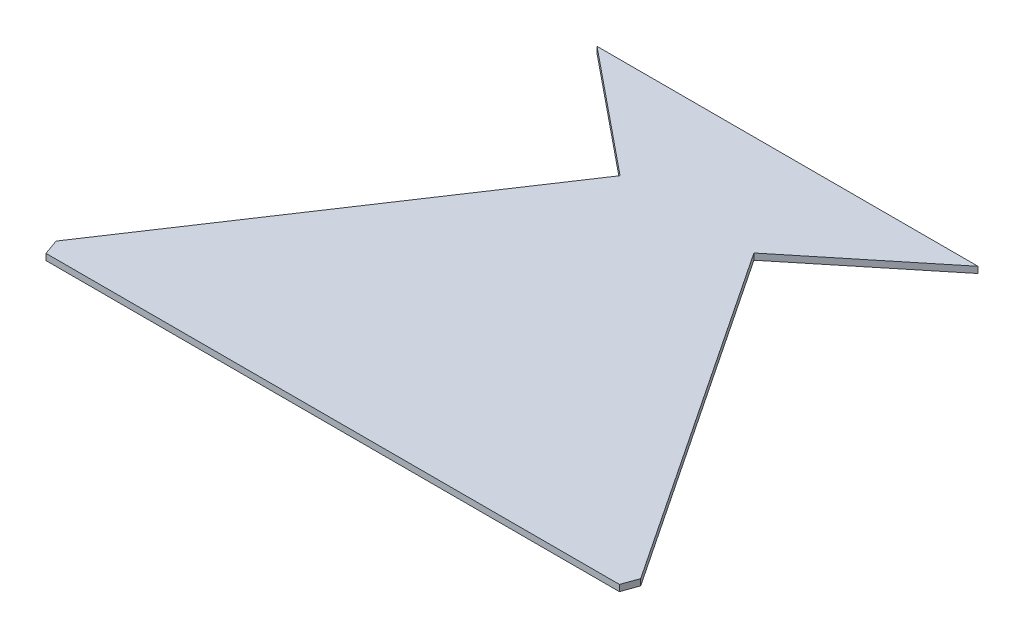
ISO-10303-21;
HEADER;
FILE_DESCRIPTION(('STEP AP214'),'2;1');
FILE_NAME('part.step','',(''),(''),'','','');
FILE_SCHEMA(('AUTOMOTIVE_DESIGN { 1 0 10303 214 1 1 1 1 }'));
ENDSEC;
DATA;
#1=APPLICATION_CONTEXT('core data for automotive mechanical design processes');
#2=APPLICATION_PROTOCOL_DEFINITION('international standard','automotive_design',2000,#1);
#3=PRODUCT_CONTEXT('',#1,'mechanical');
#4=PRODUCT('Part','Part','',(#3));
#5=PRODUCT_RELATED_PRODUCT_CATEGORY('part','',(#4));
#6=PRODUCT_DEFINITION_FORMATION('','',#4);
#7=PRODUCT_DEFINITION_CONTEXT('part definition',#1,'design');
#8=PRODUCT_DEFINITION('design','',#6,#7);
#9=PRODUCT_DEFINITION_SHAPE('','',#8);
#10=(LENGTH_UNIT() NAMED_UNIT(*) SI_UNIT(.MILLI.,.METRE.));
#11=(NAMED_UNIT(*) PLANE_ANGLE_UNIT() SI_UNIT($,.RADIAN.));
#12=(NAMED_UNIT(*) SI_UNIT($,.STERADIAN.) SOLID_ANGLE_UNIT());
#13=UNCERTAINTY_MEASURE_WITH_UNIT(LENGTH_MEASURE(1.E-05),#10,'distance_accuracy_value','');
#14=(GEOMETRIC_REPRESENTATION_CONTEXT(3) GLOBAL_UNCERTAINTY_ASSIGNED_CONTEXT((#13)) GLOBAL_UNIT_ASSIGNED_CONTEXT((#10,
#11,#12)) REPRESENTATION_CONTEXT('',''));
#15=CARTESIAN_POINT('',(0.,0.,0.));
#16=DIRECTION('',(0.,0.,1.));
#17=DIRECTION('',(1.,0.,0.));
#18=AXIS2_PLACEMENT_3D('',#15,#16,#17);
#19=CARTESIAN_POINT('',(-1.78419395601456,2.,-4.98636803668045));
#20=DIRECTION('',(0.941541493070659,0.,-0.336897041878189));
#21=DIRECTION('',(-0.336897041878189,0.,-0.941541493070659));
#22=AXIS2_PLACEMENT_3D('',#19,#20,#21);
#23=PLANE('',#22);
#24=DIRECTION('',(0.336897041878189,0.,0.941541493070659));
#25=VECTOR('',#24,1.);
#26=CARTESIAN_POINT('',(-1.78419395601456,0.,-4.98636803668045));
#27=LINE('',#26,#25);
#28=CARTESIAN_POINT('',(-1.78419395601456,0.,-4.98636803668045));
#29=VERTEX_POINT('',#28);
#30=CARTESIAN_POINT('',(0.,0.,0.));
#31=VERTEX_POINT('',#30);
#32=EDGE_CURVE('E140',#29,#31,#27,.T.);
#33=ORIENTED_EDGE('',*,*,#32,.T.);
#34=DIRECTION('',(0.,-1.,0.));
#35=VECTOR('',#34,1.);
#36=CARTESIAN_POINT('',(0.,2.,0.));
#37=LINE('',#36,#35);
#38=CARTESIAN_POINT('',(0.,2.,0.));
#39=VERTEX_POINT('',#38);
#40=EDGE_CURVE('E11',#39,#31,#37,.T.);
#41=ORIENTED_EDGE('',*,*,#40,.F.);
#42=DIRECTION('',(0.336897041878189,0.,0.941541493070659));
#43=VECTOR('',#42,1.);
#44=CARTESIAN_POINT('',(-1.78419395601456,2.,-4.98636803668045));
#45=LINE('',#44,#43);
#46=CARTESIAN_POINT('',(-1.78419395601456,2.,-4.98636803668045));
#47=VERTEX_POINT('',#46);
#48=EDGE_CURVE('E162',#47,#39,#45,.T.);
#49=ORIENTED_EDGE('',*,*,#48,.F.);
#50=DIRECTION('',(0.,-1.,0.));
#51=VECTOR('',#50,1.);
#52=CARTESIAN_POINT('',(-1.78419395601456,2.,-4.98636803668045));
#53=LINE('',#52,#51);
#54=EDGE_CURVE('E136',#47,#29,#53,.T.);
#55=ORIENTED_EDGE('',*,*,#54,.T.);
#56=EDGE_LOOP('',(#33,#41,#49,#55));
#57=FACE_BOUND('',#56,.T.);
#58=ADVANCED_FACE('F39',(#57),#23,.F.);
#59=CARTESIAN_POINT('',(0.,2.,0.));
#60=DIRECTION('',(0.,0.,-1.));
#61=DIRECTION('',(-1.,0.,0.));
#62=AXIS2_PLACEMENT_3D('',#59,#60,#61);
#63=PLANE('',#62);
#64=DIRECTION('',(1.,0.,0.));
#65=VECTOR('',#64,1.);
#66=CARTESIAN_POINT('',(0.,0.,0.));
#67=LINE('',#66,#65);
#68=CARTESIAN_POINT('',(182.41594950499,0.,0.));
#69=VERTEX_POINT('',#68);
#70=EDGE_CURVE('E144',#31,#69,#67,.T.);
#71=ORIENTED_EDGE('',*,*,#70,.T.);
#72=DIRECTION('',(0.,-1.,0.));
#73=VECTOR('',#72,1.);
#74=CARTESIAN_POINT('',(182.41594950499,2.,0.));
#75=LINE('',#74,#73);
#76=CARTESIAN_POINT('',(182.41594950499,2.,0.));
#77=VERTEX_POINT('',#76);
#78=EDGE_CURVE('E48',#77,#69,#75,.T.);
#79=ORIENTED_EDGE('',*,*,#78,.F.);
#80=DIRECTION('',(1.,0.,0.));
#81=VECTOR('',#80,1.);
#82=CARTESIAN_POINT('',(0.,2.,0.));
#83=LINE('',#82,#81);
#84=EDGE_CURVE('E99',#39,#77,#83,.T.);
#85=ORIENTED_EDGE('',*,*,#84,.F.);
#86=ORIENTED_EDGE('',*,*,#40,.T.);
#87=EDGE_LOOP('',(#71,#79,#85,#86));
#88=FACE_BOUND('',#87,.T.);
#89=ADVANCED_FACE('F208',(#88),#63,.F.);
#90=CARTESIAN_POINT('',(182.41594950499,2.,0.));
#91=DIRECTION('',(-0.941541493070657,0.,-0.336897041878193));
#92=DIRECTION('',(-0.336897041878193,0.,0.941541493070657));
#93=AXIS2_PLACEMENT_3D('',#90,#91,#92);
#94=PLANE('',#93);
#95=DIRECTION('',(0.336897041878193,0.,-0.941541493070657));
#96=VECTOR('',#95,1.);
#97=CARTESIAN_POINT('',(182.41594950499,0.,0.));
#98=LINE('',#97,#96);
#99=CARTESIAN_POINT('',(184.200143461005,0.,-4.98636803668045));
#100=VERTEX_POINT('',#99);
#101=EDGE_CURVE('E147',#69,#100,#98,.T.);
#102=ORIENTED_EDGE('',*,*,#101,.T.);
#103=DIRECTION('',(0.,-1.,0.));
#104=VECTOR('',#103,1.);
#105=CARTESIAN_POINT('',(184.200143461005,2.,-4.98636803668045));
#106=LINE('',#105,#104);
#107=CARTESIAN_POINT('',(184.200143461005,2.,-4.98636803668045));
#108=VERTEX_POINT('',#107);
#109=EDGE_CURVE('E173',#108,#100,#106,.T.);
#110=ORIENTED_EDGE('',*,*,#109,.F.);
#111=DIRECTION('',(0.336897041878193,0.,-0.941541493070657));
#112=VECTOR('',#111,1.);
#113=CARTESIAN_POINT('',(182.41594950499,2.,0.));
#114=LINE('',#113,#112);
#115=EDGE_CURVE('E183',#77,#108,#114,.T.);
#116=ORIENTED_EDGE('',*,*,#115,.F.);
#117=ORIENTED_EDGE('',*,*,#78,.T.);
#118=EDGE_LOOP('',(#102,#110,#116,#117));
#119=FACE_BOUND('',#118,.T.);
#120=ADVANCED_FACE('F181',(#119),#94,.F.);
#121=CARTESIAN_POINT('',(184.200143461005,2.,-4.98636803668045));
#122=DIRECTION('',(-0.83244154984547,0.,0.554112864036626));
#123=DIRECTION('',(0.554112864036626,0.,0.83244154984547));
#124=AXIS2_PLACEMENT_3D('',#121,#122,#123);
#125=PLANE('',#124);
#126=DIRECTION('',(-0.554112864036625,0.,-0.83244154984547));
#127=VECTOR('',#126,1.);
#128=CARTESIAN_POINT('',(184.200143461005,0.,-4.98636803668045));
#129=LINE('',#128,#127);
#130=CARTESIAN_POINT('',(112.495703750624,0.,-112.707662374589));
#131=VERTEX_POINT('',#130);
#132=EDGE_CURVE('E150',#100,#131,#129,.T.);
#133=ORIENTED_EDGE('',*,*,#132,.T.);
#134=DIRECTION('',(0.,-1.,0.));
#135=VECTOR('',#134,1.);
#136=CARTESIAN_POINT('',(112.495703750624,2.,-112.707662374589));
#137=LINE('',#136,#135);
#138=CARTESIAN_POINT('',(112.495703750624,2.,-112.707662374589));
#139=VERTEX_POINT('',#138);
#140=EDGE_CURVE('E169',#139,#131,#137,.T.);
#141=ORIENTED_EDGE('',*,*,#140,.F.);
#142=DIRECTION('',(-0.554112864036625,0.,-0.83244154984547));
#143=VECTOR('',#142,1.);
#144=CARTESIAN_POINT('',(184.200143461005,2.,-4.98636803668045));
#145=LINE('',#144,#143);
#146=EDGE_CURVE('E196',#108,#139,#145,.T.);
#147=ORIENTED_EDGE('',*,*,#146,.F.);
#148=ORIENTED_EDGE('',*,*,#109,.T.);
#149=EDGE_LOOP('',(#133,#141,#147,#148));
#150=FACE_BOUND('',#149,.T.);
#151=ADVANCED_FACE('F191',(#150),#125,.F.);
#152=CARTESIAN_POINT('',(112.495703750624,2.,-112.707662374589));
#153=DIRECTION('',(-0.631095220173793,0.,-0.775705371306524));
#154=DIRECTION('',(-0.775705371306524,0.,0.631095220173793));
#155=AXIS2_PLACEMENT_3D('',#152,#153,#154);
#156=PLANE('',#155);
#157=DIRECTION('',(0.775705371306524,0.,-0.631095220173793));
#158=VECTOR('',#157,1.);
#159=CARTESIAN_POINT('',(112.495703750624,0.,-112.707662374589));
#160=LINE('',#159,#158);
#161=CARTESIAN_POINT('',(151.80422958923,0.,-144.688132906898));
#162=VERTEX_POINT('',#161);
#163=EDGE_CURVE('E153',#131,#162,#160,.T.);
#164=ORIENTED_EDGE('',*,*,#163,.T.);
#165=DIRECTION('',(0.,-1.,0.));
#166=VECTOR('',#165,1.);
#167=CARTESIAN_POINT('',(151.80422958923,2.,-144.688132906898));
#168=LINE('',#167,#166);
#169=CARTESIAN_POINT('',(151.80422958923,2.,-144.688132906898));
#170=VERTEX_POINT('',#169);
#171=EDGE_CURVE('E129',#170,#162,#168,.T.);
#172=ORIENTED_EDGE('',*,*,#171,.F.);
#173=DIRECTION('',(0.775705371306524,0.,-0.631095220173793));
#174=VECTOR('',#173,1.);
#175=CARTESIAN_POINT('',(112.495703750624,2.,-112.707662374589));
#176=LINE('',#175,#174);
#177=EDGE_CURVE('E118',#139,#170,#176,.T.);
#178=ORIENTED_EDGE('',*,*,#177,.F.);
#179=ORIENTED_EDGE('',*,*,#140,.T.);
#180=EDGE_LOOP('',(#164,#172,#178,#179));
#181=FACE_BOUND('',#180,.T.);
#182=ADVANCED_FACE('F194',(#181),#156,.F.);
#183=CARTESIAN_POINT('',(151.80422958923,2.,-144.688132906898));
#184=DIRECTION('',(0.,0.,1.));
#185=DIRECTION('',(1.,0.,0.));
#186=AXIS2_PLACEMENT_3D('',#183,#184,#185);
#187=PLANE('',#186);
#188=DIRECTION('',(-1.,0.,0.));
#189=VECTOR('',#188,1.);
#190=CARTESIAN_POINT('',(151.80422958923,0.,-144.688132906898));
#191=LINE('',#190,#189);
#192=CARTESIAN_POINT('',(30.61171991576,0.,-144.688132906898));
#193=VERTEX_POINT('',#192);
#194=EDGE_CURVE('E127',#162,#193,#191,.T.);
#195=ORIENTED_EDGE('',*,*,#194,.T.);
#196=DIRECTION('',(0.,-1.,0.));
#197=VECTOR('',#196,1.);
#198=CARTESIAN_POINT('',(30.61171991576,2.,-144.688132906898));
#199=LINE('',#198,#197);
#200=CARTESIAN_POINT('',(30.61171991576,2.,-144.688132906898));
#201=VERTEX_POINT('',#200);
#202=EDGE_CURVE('E124',#201,#193,#199,.T.);
#203=ORIENTED_EDGE('',*,*,#202,.F.);
#204=DIRECTION('',(-1.,0.,0.));
#205=VECTOR('',#204,1.);
#206=CARTESIAN_POINT('',(151.80422958923,2.,-144.688132906898));
#207=LINE('',#206,#205);
#208=EDGE_CURVE('E112',#170,#201,#207,.T.);
#209=ORIENTED_EDGE('',*,*,#208,.F.);
#210=ORIENTED_EDGE('',*,*,#171,.T.);
#211=EDGE_LOOP('',(#195,#203,#209,#210));
#212=FACE_BOUND('',#211,.T.);
#213=ADVANCED_FACE('F125',(#212),#187,.F.);
#214=CARTESIAN_POINT('',(30.61171991576,2.,-144.688132906898));
#215=DIRECTION('',(0.631095220173793,0.,-0.775705371306524));
#216=DIRECTION('',(-0.775705371306524,0.,-0.631095220173793));
#217=AXIS2_PLACEMENT_3D('',#214,#215,#216);
#218=PLANE('',#217);
#219=DIRECTION('',(0.775705371306524,0.,0.631095220173793));
#220=VECTOR('',#219,1.);
#221=CARTESIAN_POINT('',(30.61171991576,0.,-144.688132906898));
#222=LINE('',#221,#220);
#223=CARTESIAN_POINT('',(69.9202457543665,0.,-112.707662374589));
#224=VERTEX_POINT('',#223);
#225=EDGE_CURVE('E85',#193,#224,#222,.T.);
#226=ORIENTED_EDGE('',*,*,#225,.T.);
#227=DIRECTION('',(0.,-1.,0.));
#228=VECTOR('',#227,1.);
#229=CARTESIAN_POINT('',(69.9202457543665,2.,-112.707662374589));
#230=LINE('',#229,#228);
#231=CARTESIAN_POINT('',(69.9202457543665,2.,-112.707662374589));
#232=VERTEX_POINT('',#231);
#233=EDGE_CURVE('E130',#232,#224,#230,.T.);
#234=ORIENTED_EDGE('',*,*,#233,.F.);
#235=DIRECTION('',(0.775705371306524,0.,0.631095220173793));
#236=VECTOR('',#235,1.);
#237=CARTESIAN_POINT('',(30.61171991576,2.,-144.688132906898));
#238=LINE('',#237,#236);
#239=EDGE_CURVE('E116',#201,#232,#238,.T.);
#240=ORIENTED_EDGE('',*,*,#239,.F.);
#241=ORIENTED_EDGE('',*,*,#202,.T.);
#242=EDGE_LOOP('',(#226,#234,#240,#241));
#243=FACE_BOUND('',#242,.T.);
#244=ADVANCED_FACE('F132',(#243),#218,.F.);
#245=CARTESIAN_POINT('',(69.9202457543665,2.,-112.707662374589));
#246=DIRECTION('',(0.83244154984547,0.,0.554112864036626));
#247=DIRECTION('',(0.554112864036626,0.,-0.83244154984547));
#248=AXIS2_PLACEMENT_3D('',#245,#246,#247);
#249=PLANE('',#248);
#250=DIRECTION('',(-0.554112864036625,0.,0.83244154984547));
#251=VECTOR('',#250,1.);
#252=CARTESIAN_POINT('',(69.9202457543665,0.,-112.707662374589));
#253=LINE('',#252,#251);
#254=EDGE_CURVE('E91',#224,#29,#253,.T.);
#255=ORIENTED_EDGE('',*,*,#254,.T.);
#256=ORIENTED_EDGE('',*,*,#54,.F.);
#257=DIRECTION('',(-0.554112864036625,0.,0.83244154984547));
#258=VECTOR('',#257,1.);
#259=CARTESIAN_POINT('',(69.9202457543665,2.,-112.707662374589));
#260=LINE('',#259,#258);
#261=EDGE_CURVE('E56',#232,#47,#260,.T.);
#262=ORIENTED_EDGE('',*,*,#261,.F.);
#263=ORIENTED_EDGE('',*,*,#233,.T.);
#264=EDGE_LOOP('',(#255,#256,#262,#263));
#265=FACE_BOUND('',#264,.T.);
#266=ADVANCED_FACE('F224',(#265),#249,.F.);
#267=CARTESIAN_POINT('',(0.,2.,0.));
#268=DIRECTION('',(0.,1.,0.));
#269=DIRECTION('',(0.,0.,1.));
#270=AXIS2_PLACEMENT_3D('',#267,#268,#269);
#271=PLANE('',#270);
#272=ORIENTED_EDGE('',*,*,#48,.T.);
#273=ORIENTED_EDGE('',*,*,#84,.T.);
#274=ORIENTED_EDGE('',*,*,#115,.T.);
#275=ORIENTED_EDGE('',*,*,#146,.T.);
#276=ORIENTED_EDGE('',*,*,#177,.T.);
#277=ORIENTED_EDGE('',*,*,#208,.T.);
#278=ORIENTED_EDGE('',*,*,#239,.T.);
#279=ORIENTED_EDGE('',*,*,#261,.T.);
#280=EDGE_LOOP('',(#272,#273,#274,#275,#276,#277,#278,#279));
#281=FACE_BOUND('',#280,.T.);
#282=ADVANCED_FACE('F114',(#281),#271,.T.);
#283=CARTESIAN_POINT('',(0.,0.,0.));
#284=DIRECTION('',(0.,1.,0.));
#285=DIRECTION('',(0.,0.,1.));
#286=AXIS2_PLACEMENT_3D('',#283,#284,#285);
#287=PLANE('',#286);
#288=ORIENTED_EDGE('',*,*,#32,.F.);
#289=ORIENTED_EDGE('',*,*,#254,.F.);
#290=ORIENTED_EDGE('',*,*,#225,.F.);
#291=ORIENTED_EDGE('',*,*,#194,.F.);
#292=ORIENTED_EDGE('',*,*,#163,.F.);
#293=ORIENTED_EDGE('',*,*,#132,.F.);
#294=ORIENTED_EDGE('',*,*,#101,.F.);
#295=ORIENTED_EDGE('',*,*,#70,.F.);
#296=EDGE_LOOP('',(#288,#289,#290,#291,#292,#293,#294,#295));
#297=FACE_BOUND('',#296,.T.);
#298=ADVANCED_FACE('F187',(#297),#287,.F.);
#299=CLOSED_SHELL('',(#58,#89,#120,#151,#182,#213,#244,#266,#282,#298));
#300=MANIFOLD_SOLID_BREP('B2',#299);
#301=ADVANCED_BREP_SHAPE_REPRESENTATION('',(#18,#300),#14);
#302=SHAPE_DEFINITION_REPRESENTATION(#9,#301);
ENDSEC;
END-ISO-10303-21;
